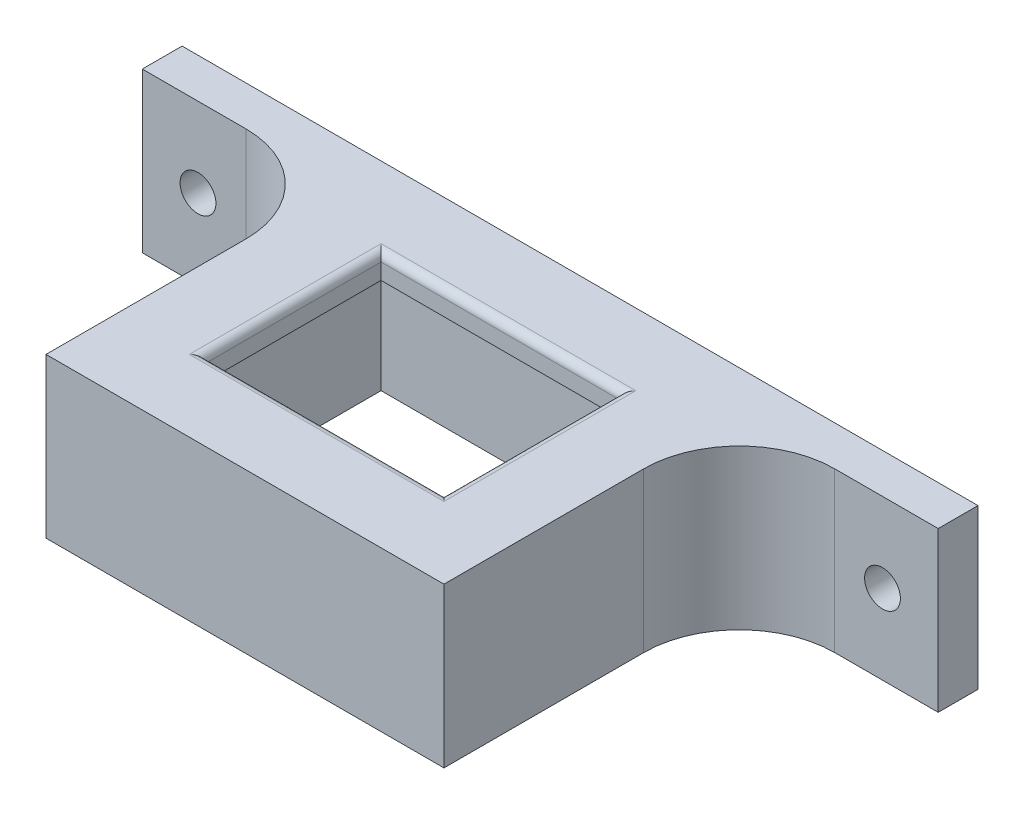
ISO-10303-21;
HEADER;
FILE_DESCRIPTION(('STEP AP214'),'2;1');
FILE_NAME('part.step','',(''),(''),'','','');
FILE_SCHEMA(('AUTOMOTIVE_DESIGN { 1 0 10303 214 1 1 1 1 }'));
ENDSEC;
DATA;
#1=APPLICATION_CONTEXT('core data for automotive mechanical design processes');
#2=APPLICATION_PROTOCOL_DEFINITION('international standard','automotive_design',2000,#1);
#3=PRODUCT_CONTEXT('',#1,'mechanical');
#4=PRODUCT('Part','Part','',(#3));
#5=PRODUCT_RELATED_PRODUCT_CATEGORY('part','',(#4));
#6=PRODUCT_DEFINITION_FORMATION('','',#4);
#7=PRODUCT_DEFINITION_CONTEXT('part definition',#1,'design');
#8=PRODUCT_DEFINITION('design','',#6,#7);
#9=PRODUCT_DEFINITION_SHAPE('','',#8);
#10=(LENGTH_UNIT() NAMED_UNIT(*) SI_UNIT(.MILLI.,.METRE.));
#11=(NAMED_UNIT(*) PLANE_ANGLE_UNIT() SI_UNIT($,.RADIAN.));
#12=(NAMED_UNIT(*) SI_UNIT($,.STERADIAN.) SOLID_ANGLE_UNIT());
#13=UNCERTAINTY_MEASURE_WITH_UNIT(LENGTH_MEASURE(1.E-05),#10,'distance_accuracy_value','');
#14=(GEOMETRIC_REPRESENTATION_CONTEXT(3) GLOBAL_UNCERTAINTY_ASSIGNED_CONTEXT((#13)) GLOBAL_UNIT_ASSIGNED_CONTEXT((#10,
#11,#12)) REPRESENTATION_CONTEXT('',''));
#15=CARTESIAN_POINT('',(0.,0.,0.));
#16=DIRECTION('',(0.,0.,1.));
#17=DIRECTION('',(1.,0.,0.));
#18=AXIS2_PLACEMENT_3D('',#15,#16,#17);
#19=CARTESIAN_POINT('',(25.,-3.,21.05));
#20=DIRECTION('',(1.,0.,0.));
#21=DIRECTION('',(0.,0.,-1.));
#22=AXIS2_PLACEMENT_3D('',#19,#20,#21);
#23=PLANE('',#22);
#24=DIRECTION('',(0.,0.,1.));
#25=VECTOR('',#24,1.);
#26=CARTESIAN_POINT('',(25.,-20.,-21.05));
#27=LINE('',#26,#25);
#28=CARTESIAN_POINT('',(25.,-20.,-4.05));
#29=VERTEX_POINT('',#28);
#30=CARTESIAN_POINT('',(25.,-20.,21.05));
#31=VERTEX_POINT('',#30);
#32=EDGE_CURVE('E293',#29,#31,#27,.T.);
#33=ORIENTED_EDGE('',*,*,#32,.F.);
#34=DIRECTION('',(0.,1.,0.));
#35=VECTOR('',#34,1.);
#36=CARTESIAN_POINT('',(25.,0.,-4.05));
#37=LINE('',#36,#35);
#38=CARTESIAN_POINT('',(25.,0.,-4.05));
#39=VERTEX_POINT('',#38);
#40=EDGE_CURVE('E405',#29,#39,#37,.T.);
#41=ORIENTED_EDGE('',*,*,#40,.T.);
#42=DIRECTION('',(0.,0.,-1.));
#43=VECTOR('',#42,1.);
#44=CARTESIAN_POINT('',(25.,0.,21.05));
#45=LINE('',#44,#43);
#46=CARTESIAN_POINT('',(25.,0.,21.05));
#47=VERTEX_POINT('',#46);
#48=EDGE_CURVE('E338',#47,#39,#45,.T.);
#49=ORIENTED_EDGE('',*,*,#48,.F.);
#50=DIRECTION('',(0.,1.,0.));
#51=VECTOR('',#50,1.);
#52=CARTESIAN_POINT('',(25.,-3.,21.05));
#53=LINE('',#52,#51);
#54=EDGE_CURVE('E347',#31,#47,#53,.T.);
#55=ORIENTED_EDGE('',*,*,#54,.F.);
#56=EDGE_LOOP('',(#33,#41,#49,#55));
#57=FACE_BOUND('',#56,.T.);
#58=ADVANCED_FACE('F39',(#57),#23,.T.);
#59=CARTESIAN_POINT('',(-25.,-3.,21.05));
#60=DIRECTION('',(0.,0.,1.));
#61=DIRECTION('',(1.,0.,0.));
#62=AXIS2_PLACEMENT_3D('',#59,#60,#61);
#63=PLANE('',#62);
#64=DIRECTION('',(1.,0.,0.));
#65=VECTOR('',#64,1.);
#66=CARTESIAN_POINT('',(-25.,0.,21.05));
#67=LINE('',#66,#65);
#68=CARTESIAN_POINT('',(-25.,0.,21.05));
#69=VERTEX_POINT('',#68);
#70=EDGE_CURVE('E323',#69,#47,#67,.T.);
#71=ORIENTED_EDGE('',*,*,#70,.F.);
#72=DIRECTION('',(0.,1.,0.));
#73=VECTOR('',#72,1.);
#74=CARTESIAN_POINT('',(-25.,-3.,21.05));
#75=LINE('',#74,#73);
#76=CARTESIAN_POINT('',(-25.,-20.,21.05));
#77=VERTEX_POINT('',#76);
#78=EDGE_CURVE('E348',#77,#69,#75,.T.);
#79=ORIENTED_EDGE('',*,*,#78,.F.);
#80=DIRECTION('',(-1.,0.,0.));
#81=VECTOR('',#80,1.);
#82=CARTESIAN_POINT('',(25.,-20.,21.05));
#83=LINE('',#82,#81);
#84=EDGE_CURVE('E296',#31,#77,#83,.T.);
#85=ORIENTED_EDGE('',*,*,#84,.F.);
#86=ORIENTED_EDGE('',*,*,#54,.T.);
#87=EDGE_LOOP('',(#71,#79,#85,#86));
#88=FACE_BOUND('',#87,.T.);
#89=ADVANCED_FACE('F437',(#88),#63,.T.);
#90=CARTESIAN_POINT('',(-25.,-3.,21.05));
#91=DIRECTION('',(-1.,0.,0.));
#92=DIRECTION('',(0.,0.,1.));
#93=AXIS2_PLACEMENT_3D('',#90,#91,#92);
#94=PLANE('',#93);
#95=DIRECTION('',(0.,0.,1.));
#96=VECTOR('',#95,1.);
#97=CARTESIAN_POINT('',(-25.,0.,21.05));
#98=LINE('',#97,#96);
#99=CARTESIAN_POINT('',(-25.,0.,-4.05));
#100=VERTEX_POINT('',#99);
#101=EDGE_CURVE('E344',#100,#69,#98,.T.);
#102=ORIENTED_EDGE('',*,*,#101,.F.);
#103=DIRECTION('',(0.,1.,0.));
#104=VECTOR('',#103,1.);
#105=CARTESIAN_POINT('',(-25.,-20.,-4.05));
#106=LINE('',#105,#104);
#107=CARTESIAN_POINT('',(-25.,-20.,-4.05));
#108=VERTEX_POINT('',#107);
#109=EDGE_CURVE('E402',#100,#108,#106,.F.);
#110=ORIENTED_EDGE('',*,*,#109,.T.);
#111=DIRECTION('',(0.,0.,-1.));
#112=VECTOR('',#111,1.);
#113=CARTESIAN_POINT('',(-25.,-20.,-21.05));
#114=LINE('',#113,#112);
#115=EDGE_CURVE('E287',#77,#108,#114,.T.);
#116=ORIENTED_EDGE('',*,*,#115,.F.);
#117=ORIENTED_EDGE('',*,*,#78,.T.);
#118=EDGE_LOOP('',(#102,#110,#116,#117));
#119=FACE_BOUND('',#118,.T.);
#120=ADVANCED_FACE('F421',(#119),#94,.T.);
#121=CARTESIAN_POINT('',(-25.,-3.,-21.05));
#122=DIRECTION('',(0.,0.,-1.));
#123=DIRECTION('',(-1.,0.,0.));
#124=AXIS2_PLACEMENT_3D('',#121,#122,#123);
#125=PLANE('',#124);
#126=CARTESIAN_POINT('',(-43.,-10.,-21.05));
#127=DIRECTION('',(0.,0.,-1.));
#128=DIRECTION('',(-1.,0.,0.));
#129=AXIS2_PLACEMENT_3D('',#126,#127,#128);
#130=CIRCLE('',#129,2.275);
#131=CARTESIAN_POINT('',(-45.275,-10.,-21.05));
#132=VERTEX_POINT('',#131);
#133=EDGE_CURVE('E517',#132,#132,#130,.T.);
#134=ORIENTED_EDGE('',*,*,#133,.F.);
#135=EDGE_LOOP('',(#134));
#136=FACE_BOUND('',#135,.T.);
#137=CARTESIAN_POINT('',(43.,-10.,-21.05));
#138=DIRECTION('',(0.,0.,-1.));
#139=DIRECTION('',(-1.,0.,0.));
#140=AXIS2_PLACEMENT_3D('',#137,#138,#139);
#141=CIRCLE('',#140,2.275);
#142=CARTESIAN_POINT('',(40.725,-10.,-21.05));
#143=VERTEX_POINT('',#142);
#144=EDGE_CURVE('E204',#143,#143,#141,.T.);
#145=ORIENTED_EDGE('',*,*,#144,.F.);
#146=EDGE_LOOP('',(#145));
#147=FACE_BOUND('',#146,.T.);
#148=DIRECTION('',(-1.,0.,0.));
#149=VECTOR('',#148,1.);
#150=CARTESIAN_POINT('',(-25.,0.,-21.05));
#151=LINE('',#150,#149);
#152=CARTESIAN_POINT('',(50.,0.,-21.05));
#153=VERTEX_POINT('',#152);
#154=CARTESIAN_POINT('',(-50.,0.,-21.05));
#155=VERTEX_POINT('',#154);
#156=EDGE_CURVE('E341',#153,#155,#151,.T.);
#157=ORIENTED_EDGE('',*,*,#156,.F.);
#158=DIRECTION('',(0.,-1.,0.));
#159=VECTOR('',#158,1.);
#160=CARTESIAN_POINT('',(50.,0.,-21.05));
#161=LINE('',#160,#159);
#162=CARTESIAN_POINT('',(50.,-20.,-21.05));
#163=VERTEX_POINT('',#162);
#164=EDGE_CURVE('E223',#153,#163,#161,.T.);
#165=ORIENTED_EDGE('',*,*,#164,.T.);
#166=DIRECTION('',(1.,0.,0.));
#167=VECTOR('',#166,1.);
#168=CARTESIAN_POINT('',(25.,-20.,-21.05));
#169=LINE('',#168,#167);
#170=CARTESIAN_POINT('',(-50.,-20.,-21.05));
#171=VERTEX_POINT('',#170);
#172=EDGE_CURVE('E290',#171,#163,#169,.T.);
#173=ORIENTED_EDGE('',*,*,#172,.F.);
#174=DIRECTION('',(0.,-1.,0.));
#175=VECTOR('',#174,1.);
#176=CARTESIAN_POINT('',(-50.,0.,-21.05));
#177=LINE('',#176,#175);
#178=EDGE_CURVE('E184',#155,#171,#177,.T.);
#179=ORIENTED_EDGE('',*,*,#178,.F.);
#180=EDGE_LOOP('',(#157,#165,#173,#179));
#181=FACE_BOUND('',#180,.T.);
#182=ADVANCED_FACE('F447',(#136,#147,#181),#125,.T.);
#183=CARTESIAN_POINT('',(0.,-3.,0.));
#184=DIRECTION('',(0.,1.,0.));
#185=DIRECTION('',(0.,0.,1.));
#186=AXIS2_PLACEMENT_3D('',#183,#184,#185);
#187=PLANE('',#186);
#188=DIRECTION('',(0.,0.,-1.));
#189=VECTOR('',#188,1.);
#190=CARTESIAN_POINT('',(-20.,-3.,-16.05));
#191=LINE('',#190,#189);
#192=CARTESIAN_POINT('',(-20.,-3.,16.05));
#193=VERTEX_POINT('',#192);
#194=CARTESIAN_POINT('',(-20.,-3.,-16.05));
#195=VERTEX_POINT('',#194);
#196=EDGE_CURVE('E250',#193,#195,#191,.T.);
#197=ORIENTED_EDGE('',*,*,#196,.T.);
#198=DIRECTION('',(1.,0.,0.));
#199=VECTOR('',#198,1.);
#200=CARTESIAN_POINT('',(20.,-3.,-16.05));
#201=LINE('',#200,#199);
#202=CARTESIAN_POINT('',(20.,-3.,-16.05));
#203=VERTEX_POINT('',#202);
#204=EDGE_CURVE('E234',#195,#203,#201,.T.);
#205=ORIENTED_EDGE('',*,*,#204,.T.);
#206=DIRECTION('',(0.,0.,1.));
#207=VECTOR('',#206,1.);
#208=CARTESIAN_POINT('',(20.,-3.,-16.05));
#209=LINE('',#208,#207);
#210=CARTESIAN_POINT('',(20.,-3.,16.05));
#211=VERTEX_POINT('',#210);
#212=EDGE_CURVE('E264',#203,#211,#209,.T.);
#213=ORIENTED_EDGE('',*,*,#212,.T.);
#214=DIRECTION('',(-1.,0.,0.));
#215=VECTOR('',#214,1.);
#216=CARTESIAN_POINT('',(20.,-3.,16.05));
#217=LINE('',#216,#215);
#218=EDGE_CURVE('E268',#211,#193,#217,.T.);
#219=ORIENTED_EDGE('',*,*,#218,.T.);
#220=EDGE_LOOP('',(#197,#205,#213,#219));
#221=FACE_BOUND('',#220,.T.);
#222=DIRECTION('',(1.,0.,0.));
#223=VECTOR('',#222,1.);
#224=CARTESIAN_POINT('',(-15.,-3.,11.05));
#225=LINE('',#224,#223);
#226=CARTESIAN_POINT('',(-15.,-3.,11.05));
#227=VERTEX_POINT('',#226);
#228=CARTESIAN_POINT('',(15.,-3.,11.05));
#229=VERTEX_POINT('',#228);
#230=EDGE_CURVE('E314',#227,#229,#225,.T.);
#231=ORIENTED_EDGE('',*,*,#230,.T.);
#232=DIRECTION('',(0.,0.,-1.));
#233=VECTOR('',#232,1.);
#234=CARTESIAN_POINT('',(15.,-3.,11.05));
#235=LINE('',#234,#233);
#236=CARTESIAN_POINT('',(15.,-3.,-11.05));
#237=VERTEX_POINT('',#236);
#238=EDGE_CURVE('E301',#229,#237,#235,.T.);
#239=ORIENTED_EDGE('',*,*,#238,.T.);
#240=DIRECTION('',(-1.,0.,0.));
#241=VECTOR('',#240,1.);
#242=CARTESIAN_POINT('',(-15.,-3.,-11.05));
#243=LINE('',#242,#241);
#244=CARTESIAN_POINT('',(-15.,-3.,-11.05));
#245=VERTEX_POINT('',#244);
#246=EDGE_CURVE('E305',#237,#245,#243,.T.);
#247=ORIENTED_EDGE('',*,*,#246,.T.);
#248=DIRECTION('',(0.,0.,1.));
#249=VECTOR('',#248,1.);
#250=CARTESIAN_POINT('',(-15.,-3.,11.05));
#251=LINE('',#250,#249);
#252=EDGE_CURVE('E310',#245,#227,#251,.T.);
#253=ORIENTED_EDGE('',*,*,#252,.T.);
#254=EDGE_LOOP('',(#231,#239,#247,#253));
#255=FACE_BOUND('',#254,.T.);
#256=ADVANCED_FACE('F491',(#221,#255),#187,.F.);
#257=CARTESIAN_POINT('',(0.,0.,0.));
#258=DIRECTION('',(0.,1.,0.));
#259=DIRECTION('',(0.,0.,1.));
#260=AXIS2_PLACEMENT_3D('',#257,#258,#259);
#261=PLANE('',#260);
#262=DIRECTION('',(0.,0.,-1.));
#263=VECTOR('',#262,1.);
#264=CARTESIAN_POINT('',(16.,0.,11.05));
#265=LINE('',#264,#263);
#266=CARTESIAN_POINT('',(16.,0.,-12.05));
#267=VERTEX_POINT('',#266);
#268=CARTESIAN_POINT('',(16.,0.,12.05));
#269=VERTEX_POINT('',#268);
#270=EDGE_CURVE('E364',#267,#269,#265,.F.);
#271=ORIENTED_EDGE('',*,*,#270,.T.);
#272=DIRECTION('',(1.,0.,0.));
#273=VECTOR('',#272,1.);
#274=CARTESIAN_POINT('',(-15.,0.,12.05));
#275=LINE('',#274,#273);
#276=CARTESIAN_POINT('',(-16.,0.,12.05));
#277=VERTEX_POINT('',#276);
#278=EDGE_CURVE('E367',#269,#277,#275,.F.);
#279=ORIENTED_EDGE('',*,*,#278,.T.);
#280=DIRECTION('',(0.,0.,1.));
#281=VECTOR('',#280,1.);
#282=CARTESIAN_POINT('',(-16.,0.,-11.05));
#283=LINE('',#282,#281);
#284=CARTESIAN_POINT('',(-16.,0.,-12.05));
#285=VERTEX_POINT('',#284);
#286=EDGE_CURVE('E358',#277,#285,#283,.F.);
#287=ORIENTED_EDGE('',*,*,#286,.T.);
#288=DIRECTION('',(-1.,0.,0.));
#289=VECTOR('',#288,1.);
#290=CARTESIAN_POINT('',(15.,0.,-12.05));
#291=LINE('',#290,#289);
#292=EDGE_CURVE('E361',#285,#267,#291,.F.);
#293=ORIENTED_EDGE('',*,*,#292,.T.);
#294=EDGE_LOOP('',(#271,#279,#287,#293));
#295=FACE_BOUND('',#294,.T.);
#296=ORIENTED_EDGE('',*,*,#70,.T.);
#297=ORIENTED_EDGE('',*,*,#48,.T.);
#298=CARTESIAN_POINT('',(37.,0.,-4.05));
#299=DIRECTION('',(0.,1.,0.));
#300=DIRECTION('',(0.,0.,1.));
#301=AXIS2_PLACEMENT_3D('',#298,#299,#300);
#302=CIRCLE('',#301,12.);
#303=CARTESIAN_POINT('',(37.,0.,-16.05));
#304=VERTEX_POINT('',#303);
#305=EDGE_CURVE('E48',#39,#304,#302,.F.);
#306=ORIENTED_EDGE('',*,*,#305,.T.);
#307=DIRECTION('',(1.,0.,0.));
#308=VECTOR('',#307,1.);
#309=CARTESIAN_POINT('',(25.,0.,-16.05));
#310=LINE('',#309,#308);
#311=CARTESIAN_POINT('',(50.,0.,-16.05));
#312=VERTEX_POINT('',#311);
#313=EDGE_CURVE('E227',#304,#312,#310,.T.);
#314=ORIENTED_EDGE('',*,*,#313,.T.);
#315=DIRECTION('',(0.,0.,-1.));
#316=VECTOR('',#315,1.);
#317=CARTESIAN_POINT('',(50.,0.,15.9656211871643));
#318=LINE('',#317,#316);
#319=EDGE_CURVE('E230',#312,#153,#318,.T.);
#320=ORIENTED_EDGE('',*,*,#319,.T.);
#321=ORIENTED_EDGE('',*,*,#156,.T.);
#322=DIRECTION('',(0.,0.,-1.));
#323=VECTOR('',#322,1.);
#324=CARTESIAN_POINT('',(-50.,0.,15.9656211871643));
#325=LINE('',#324,#323);
#326=CARTESIAN_POINT('',(-50.,0.,-16.05));
#327=VERTEX_POINT('',#326);
#328=EDGE_CURVE('E215',#327,#155,#325,.T.);
#329=ORIENTED_EDGE('',*,*,#328,.F.);
#330=DIRECTION('',(-1.,0.,0.));
#331=VECTOR('',#330,1.);
#332=CARTESIAN_POINT('',(-25.,0.,-16.05));
#333=LINE('',#332,#331);
#334=CARTESIAN_POINT('',(-37.,0.,-16.05));
#335=VERTEX_POINT('',#334);
#336=EDGE_CURVE('E199',#335,#327,#333,.T.);
#337=ORIENTED_EDGE('',*,*,#336,.F.);
#338=CARTESIAN_POINT('',(-37.,0.,-4.05));
#339=DIRECTION('',(0.,1.,0.));
#340=DIRECTION('',(0.,0.,1.));
#341=AXIS2_PLACEMENT_3D('',#338,#339,#340);
#342=CIRCLE('',#341,12.);
#343=EDGE_CURVE('E411',#335,#100,#342,.F.);
#344=ORIENTED_EDGE('',*,*,#343,.T.);
#345=ORIENTED_EDGE('',*,*,#101,.T.);
#346=EDGE_LOOP('',(#296,#297,#306,#314,#320,#321,#329,#337,#344,#345));
#347=FACE_BOUND('',#346,.T.);
#348=ADVANCED_FACE('F417',(#295,#347),#261,.T.);
#349=CARTESIAN_POINT('',(15.,-3.,11.05));
#350=DIRECTION('',(1.,0.,0.));
#351=DIRECTION('',(0.,0.,-1.));
#352=AXIS2_PLACEMENT_3D('',#349,#350,#351);
#353=PLANE('',#352);
#354=DIRECTION('',(0.,1.,0.));
#355=VECTOR('',#354,1.);
#356=CARTESIAN_POINT('',(15.,-3.,11.05));
#357=LINE('',#356,#355);
#358=CARTESIAN_POINT('',(15.,-1.,11.05));
#359=VERTEX_POINT('',#358);
#360=EDGE_CURVE('E319',#229,#359,#357,.T.);
#361=ORIENTED_EDGE('',*,*,#360,.T.);
#362=DIRECTION('',(0.,0.,-1.));
#363=VECTOR('',#362,1.);
#364=CARTESIAN_POINT('',(15.,-1.,-11.05));
#365=LINE('',#364,#363);
#366=CARTESIAN_POINT('',(15.,-1.,-11.05));
#367=VERTEX_POINT('',#366);
#368=EDGE_CURVE('E371',#359,#367,#365,.T.);
#369=ORIENTED_EDGE('',*,*,#368,.T.);
#370=DIRECTION('',(0.,1.,0.));
#371=VECTOR('',#370,1.);
#372=CARTESIAN_POINT('',(15.,-3.,-11.05));
#373=LINE('',#372,#371);
#374=EDGE_CURVE('E318',#237,#367,#373,.T.);
#375=ORIENTED_EDGE('',*,*,#374,.F.);
#376=ORIENTED_EDGE('',*,*,#238,.F.);
#377=EDGE_LOOP('',(#361,#369,#375,#376));
#378=FACE_BOUND('',#377,.T.);
#379=ADVANCED_FACE('F494',(#378),#353,.F.);
#380=CARTESIAN_POINT('',(-15.,-3.,11.05));
#381=DIRECTION('',(0.,0.,1.));
#382=DIRECTION('',(1.,0.,0.));
#383=AXIS2_PLACEMENT_3D('',#380,#381,#382);
#384=PLANE('',#383);
#385=DIRECTION('',(0.,1.,0.));
#386=VECTOR('',#385,1.);
#387=CARTESIAN_POINT('',(-15.,-3.,11.05));
#388=LINE('',#387,#386);
#389=CARTESIAN_POINT('',(-15.,-1.,11.05));
#390=VERTEX_POINT('',#389);
#391=EDGE_CURVE('E324',#227,#390,#388,.T.);
#392=ORIENTED_EDGE('',*,*,#391,.T.);
#393=DIRECTION('',(1.,0.,0.));
#394=VECTOR('',#393,1.);
#395=CARTESIAN_POINT('',(15.,-1.,11.05));
#396=LINE('',#395,#394);
#397=EDGE_CURVE('E352',#390,#359,#396,.T.);
#398=ORIENTED_EDGE('',*,*,#397,.T.);
#399=ORIENTED_EDGE('',*,*,#360,.F.);
#400=ORIENTED_EDGE('',*,*,#230,.F.);
#401=EDGE_LOOP('',(#392,#398,#399,#400));
#402=FACE_BOUND('',#401,.T.);
#403=ADVANCED_FACE('F488',(#402),#384,.F.);
#404=CARTESIAN_POINT('',(-15.,-3.,11.05));
#405=DIRECTION('',(-1.,0.,0.));
#406=DIRECTION('',(0.,0.,1.));
#407=AXIS2_PLACEMENT_3D('',#404,#405,#406);
#408=PLANE('',#407);
#409=DIRECTION('',(0.,1.,0.));
#410=VECTOR('',#409,1.);
#411=CARTESIAN_POINT('',(-15.,-3.,-11.05));
#412=LINE('',#411,#410);
#413=CARTESIAN_POINT('',(-15.,-1.,-11.05));
#414=VERTEX_POINT('',#413);
#415=EDGE_CURVE('E328',#245,#414,#412,.T.);
#416=ORIENTED_EDGE('',*,*,#415,.T.);
#417=DIRECTION('',(0.,0.,1.));
#418=VECTOR('',#417,1.);
#419=CARTESIAN_POINT('',(-15.,-1.,11.05));
#420=LINE('',#419,#418);
#421=EDGE_CURVE('E377',#414,#390,#420,.T.);
#422=ORIENTED_EDGE('',*,*,#421,.T.);
#423=ORIENTED_EDGE('',*,*,#391,.F.);
#424=ORIENTED_EDGE('',*,*,#252,.F.);
#425=EDGE_LOOP('',(#416,#422,#423,#424));
#426=FACE_BOUND('',#425,.T.);
#427=ADVANCED_FACE('F468',(#426),#408,.F.);
#428=CARTESIAN_POINT('',(-15.,-3.,-11.05));
#429=DIRECTION('',(0.,0.,-1.));
#430=DIRECTION('',(-1.,0.,0.));
#431=AXIS2_PLACEMENT_3D('',#428,#429,#430);
#432=PLANE('',#431);
#433=ORIENTED_EDGE('',*,*,#374,.T.);
#434=DIRECTION('',(-1.,0.,0.));
#435=VECTOR('',#434,1.);
#436=CARTESIAN_POINT('',(-15.,-1.,-11.05));
#437=LINE('',#436,#435);
#438=EDGE_CURVE('E374',#367,#414,#437,.T.);
#439=ORIENTED_EDGE('',*,*,#438,.T.);
#440=ORIENTED_EDGE('',*,*,#415,.F.);
#441=ORIENTED_EDGE('',*,*,#246,.F.);
#442=EDGE_LOOP('',(#433,#439,#440,#441));
#443=FACE_BOUND('',#442,.T.);
#444=ADVANCED_FACE('F463',(#443),#432,.F.);
#445=CARTESIAN_POINT('',(-15.,-1.,-12.05));
#446=DIRECTION('',(1.,0.,0.));
#447=DIRECTION('',(0.,0.,-1.));
#448=AXIS2_PLACEMENT_3D('',#445,#446,#447);
#449=CYLINDRICAL_SURFACE('',#448,1.);
#450=CARTESIAN_POINT('',(16.,-1.,-12.05));
#451=DIRECTION('',(0.707106781186547,0.,0.707106781186547));
#452=DIRECTION('',(-0.707106781186547,0.,0.707106781186547));
#453=AXIS2_PLACEMENT_3D('',#450,#451,#452);
#454=ELLIPSE('',#453,1.41421356237309,1.);
#455=EDGE_CURVE('E386',#267,#367,#454,.T.);
#456=ORIENTED_EDGE('',*,*,#455,.F.);
#457=ORIENTED_EDGE('',*,*,#292,.F.);
#458=CARTESIAN_POINT('',(-16.,-1.,-12.05));
#459=DIRECTION('',(0.707106781186547,0.,-0.707106781186547));
#460=DIRECTION('',(0.707106781186547,0.,0.707106781186547));
#461=AXIS2_PLACEMENT_3D('',#458,#459,#460);
#462=ELLIPSE('',#461,1.41421356237309,1.);
#463=EDGE_CURVE('E306',#414,#285,#462,.F.);
#464=ORIENTED_EDGE('',*,*,#463,.F.);
#465=ORIENTED_EDGE('',*,*,#438,.F.);
#466=EDGE_LOOP('',(#456,#457,#464,#465));
#467=FACE_BOUND('',#466,.T.);
#468=ADVANCED_FACE('F460',(#467),#449,.T.);
#469=CARTESIAN_POINT('',(-16.,-1.,11.05));
#470=DIRECTION('',(0.,0.,-1.));
#471=DIRECTION('',(-1.,0.,0.));
#472=AXIS2_PLACEMENT_3D('',#469,#470,#471);
#473=CYLINDRICAL_SURFACE('',#472,1.);
#474=ORIENTED_EDGE('',*,*,#463,.T.);
#475=ORIENTED_EDGE('',*,*,#286,.F.);
#476=CARTESIAN_POINT('',(-16.,-1.,12.05));
#477=DIRECTION('',(-0.707106781186547,0.,-0.707106781186547));
#478=DIRECTION('',(-0.707106781186547,0.,0.707106781186547));
#479=AXIS2_PLACEMENT_3D('',#476,#477,#478);
#480=ELLIPSE('',#479,1.41421356237309,1.);
#481=EDGE_CURVE('E383',#390,#277,#480,.F.);
#482=ORIENTED_EDGE('',*,*,#481,.F.);
#483=ORIENTED_EDGE('',*,*,#421,.F.);
#484=EDGE_LOOP('',(#474,#475,#482,#483));
#485=FACE_BOUND('',#484,.T.);
#486=ADVANCED_FACE('F457',(#485),#473,.T.);
#487=CARTESIAN_POINT('',(16.,-1.,11.05));
#488=DIRECTION('',(0.,0.,1.));
#489=DIRECTION('',(1.,0.,0.));
#490=AXIS2_PLACEMENT_3D('',#487,#488,#489);
#491=CYLINDRICAL_SURFACE('',#490,1.);
#492=ORIENTED_EDGE('',*,*,#455,.T.);
#493=ORIENTED_EDGE('',*,*,#368,.F.);
#494=CARTESIAN_POINT('',(16.,-1.,12.05));
#495=DIRECTION('',(-0.707106781186547,0.,0.707106781186547));
#496=DIRECTION('',(-0.707106781186547,0.,-0.707106781186547));
#497=AXIS2_PLACEMENT_3D('',#494,#495,#496);
#498=ELLIPSE('',#497,1.41421356237309,1.);
#499=EDGE_CURVE('E300',#269,#359,#498,.T.);
#500=ORIENTED_EDGE('',*,*,#499,.F.);
#501=ORIENTED_EDGE('',*,*,#270,.F.);
#502=EDGE_LOOP('',(#492,#493,#500,#501));
#503=FACE_BOUND('',#502,.T.);
#504=ADVANCED_FACE('F453',(#503),#491,.T.);
#505=CARTESIAN_POINT('',(-15.,-1.,12.05));
#506=DIRECTION('',(-1.,0.,0.));
#507=DIRECTION('',(0.,0.,1.));
#508=AXIS2_PLACEMENT_3D('',#505,#506,#507);
#509=CYLINDRICAL_SURFACE('',#508,1.);
#510=ORIENTED_EDGE('',*,*,#481,.T.);
#511=ORIENTED_EDGE('',*,*,#278,.F.);
#512=ORIENTED_EDGE('',*,*,#499,.T.);
#513=ORIENTED_EDGE('',*,*,#397,.F.);
#514=EDGE_LOOP('',(#510,#511,#512,#513));
#515=FACE_BOUND('',#514,.T.);
#516=ADVANCED_FACE('F450',(#515),#509,.T.);
#517=CARTESIAN_POINT('',(0.,-20.,0.));
#518=DIRECTION('',(0.,-1.,0.));
#519=DIRECTION('',(0.,0.,-1.));
#520=AXIS2_PLACEMENT_3D('',#517,#518,#519);
#521=PLANE('',#520);
#522=ORIENTED_EDGE('',*,*,#115,.T.);
#523=CARTESIAN_POINT('',(-37.,-20.,-4.05));
#524=DIRECTION('',(0.,-1.,0.));
#525=DIRECTION('',(0.,0.,-1.));
#526=AXIS2_PLACEMENT_3D('',#523,#524,#525);
#527=CIRCLE('',#526,12.);
#528=CARTESIAN_POINT('',(-37.,-20.,-16.05));
#529=VERTEX_POINT('',#528);
#530=EDGE_CURVE('E194',#108,#529,#527,.F.);
#531=ORIENTED_EDGE('',*,*,#530,.T.);
#532=DIRECTION('',(1.,0.,0.));
#533=VECTOR('',#532,1.);
#534=CARTESIAN_POINT('',(-25.,-20.,-16.05));
#535=LINE('',#534,#533);
#536=CARTESIAN_POINT('',(-50.,-20.,-16.05));
#537=VERTEX_POINT('',#536);
#538=EDGE_CURVE('E187',#537,#529,#535,.T.);
#539=ORIENTED_EDGE('',*,*,#538,.F.);
#540=DIRECTION('',(0.,0.,-1.));
#541=VECTOR('',#540,1.);
#542=CARTESIAN_POINT('',(-50.,-20.,15.9656211871643));
#543=LINE('',#542,#541);
#544=EDGE_CURVE('E176',#537,#171,#543,.T.);
#545=ORIENTED_EDGE('',*,*,#544,.T.);
#546=ORIENTED_EDGE('',*,*,#172,.T.);
#547=DIRECTION('',(0.,0.,-1.));
#548=VECTOR('',#547,1.);
#549=CARTESIAN_POINT('',(50.,-20.,15.9656211871643));
#550=LINE('',#549,#548);
#551=CARTESIAN_POINT('',(50.,-20.,-16.05));
#552=VERTEX_POINT('',#551);
#553=EDGE_CURVE('E235',#552,#163,#550,.T.);
#554=ORIENTED_EDGE('',*,*,#553,.F.);
#555=DIRECTION('',(-1.,0.,0.));
#556=VECTOR('',#555,1.);
#557=CARTESIAN_POINT('',(25.,-20.,-16.05));
#558=LINE('',#557,#556);
#559=CARTESIAN_POINT('',(37.,-20.,-16.05));
#560=VERTEX_POINT('',#559);
#561=EDGE_CURVE('E231',#552,#560,#558,.T.);
#562=ORIENTED_EDGE('',*,*,#561,.T.);
#563=CARTESIAN_POINT('',(37.,-20.,-4.05));
#564=DIRECTION('',(0.,-1.,0.));
#565=DIRECTION('',(0.,0.,-1.));
#566=AXIS2_PLACEMENT_3D('',#563,#564,#565);
#567=CIRCLE('',#566,12.);
#568=EDGE_CURVE('E11',#560,#29,#567,.F.);
#569=ORIENTED_EDGE('',*,*,#568,.T.);
#570=ORIENTED_EDGE('',*,*,#32,.T.);
#571=ORIENTED_EDGE('',*,*,#84,.T.);
#572=EDGE_LOOP('',(#522,#531,#539,#545,#546,#554,#562,#569,#570,#571));
#573=FACE_BOUND('',#572,.T.);
#574=DIRECTION('',(0.,0.,1.));
#575=VECTOR('',#574,1.);
#576=CARTESIAN_POINT('',(20.,-20.,-16.05));
#577=LINE('',#576,#575);
#578=CARTESIAN_POINT('',(20.,-20.,-16.05));
#579=VERTEX_POINT('',#578);
#580=CARTESIAN_POINT('',(20.,-20.,16.05));
#581=VERTEX_POINT('',#580);
#582=EDGE_CURVE('E249',#579,#581,#577,.T.);
#583=ORIENTED_EDGE('',*,*,#582,.F.);
#584=DIRECTION('',(1.,0.,0.));
#585=VECTOR('',#584,1.);
#586=CARTESIAN_POINT('',(20.,-20.,-16.05));
#587=LINE('',#586,#585);
#588=CARTESIAN_POINT('',(-20.,-20.,-16.05));
#589=VERTEX_POINT('',#588);
#590=EDGE_CURVE('E246',#589,#579,#587,.T.);
#591=ORIENTED_EDGE('',*,*,#590,.F.);
#592=DIRECTION('',(0.,0.,-1.));
#593=VECTOR('',#592,1.);
#594=CARTESIAN_POINT('',(-20.,-20.,-16.05));
#595=LINE('',#594,#593);
#596=CARTESIAN_POINT('',(-20.,-20.,16.05));
#597=VERTEX_POINT('',#596);
#598=EDGE_CURVE('E257',#597,#589,#595,.T.);
#599=ORIENTED_EDGE('',*,*,#598,.F.);
#600=DIRECTION('',(-1.,0.,0.));
#601=VECTOR('',#600,1.);
#602=CARTESIAN_POINT('',(20.,-20.,16.05));
#603=LINE('',#602,#601);
#604=EDGE_CURVE('E253',#581,#597,#603,.T.);
#605=ORIENTED_EDGE('',*,*,#604,.F.);
#606=EDGE_LOOP('',(#583,#591,#599,#605));
#607=FACE_BOUND('',#606,.T.);
#608=ADVANCED_FACE('F191',(#573,#607),#521,.T.);
#609=CARTESIAN_POINT('',(20.,-20.,-16.05));
#610=DIRECTION('',(0.,0.,1.));
#611=DIRECTION('',(1.,0.,0.));
#612=AXIS2_PLACEMENT_3D('',#609,#610,#611);
#613=PLANE('',#612);
#614=ORIENTED_EDGE('',*,*,#204,.F.);
#615=DIRECTION('',(0.,1.,0.));
#616=VECTOR('',#615,1.);
#617=CARTESIAN_POINT('',(-20.,-20.,-16.05));
#618=LINE('',#617,#616);
#619=EDGE_CURVE('E260',#589,#195,#618,.T.);
#620=ORIENTED_EDGE('',*,*,#619,.F.);
#621=ORIENTED_EDGE('',*,*,#590,.T.);
#622=DIRECTION('',(0.,1.,0.));
#623=VECTOR('',#622,1.);
#624=CARTESIAN_POINT('',(20.,-20.,-16.05));
#625=LINE('',#624,#623);
#626=EDGE_CURVE('E283',#579,#203,#625,.T.);
#627=ORIENTED_EDGE('',*,*,#626,.T.);
#628=EDGE_LOOP('',(#614,#620,#621,#627));
#629=FACE_BOUND('',#628,.T.);
#630=ADVANCED_FACE('F554',(#629),#613,.T.);
#631=CARTESIAN_POINT('',(20.,-20.,-16.05));
#632=DIRECTION('',(-1.,0.,0.));
#633=DIRECTION('',(0.,0.,1.));
#634=AXIS2_PLACEMENT_3D('',#631,#632,#633);
#635=PLANE('',#634);
#636=ORIENTED_EDGE('',*,*,#212,.F.);
#637=ORIENTED_EDGE('',*,*,#626,.F.);
#638=ORIENTED_EDGE('',*,*,#582,.T.);
#639=DIRECTION('',(0.,1.,0.));
#640=VECTOR('',#639,1.);
#641=CARTESIAN_POINT('',(20.,-20.,16.05));
#642=LINE('',#641,#640);
#643=EDGE_CURVE('E280',#581,#211,#642,.T.);
#644=ORIENTED_EDGE('',*,*,#643,.T.);
#645=EDGE_LOOP('',(#636,#637,#638,#644));
#646=FACE_BOUND('',#645,.T.);
#647=ADVANCED_FACE('F550',(#646),#635,.T.);
#648=CARTESIAN_POINT('',(20.,-20.,16.05));
#649=DIRECTION('',(0.,0.,-1.));
#650=DIRECTION('',(-1.,0.,0.));
#651=AXIS2_PLACEMENT_3D('',#648,#649,#650);
#652=PLANE('',#651);
#653=ORIENTED_EDGE('',*,*,#218,.F.);
#654=ORIENTED_EDGE('',*,*,#643,.F.);
#655=ORIENTED_EDGE('',*,*,#604,.T.);
#656=DIRECTION('',(0.,1.,0.));
#657=VECTOR('',#656,1.);
#658=CARTESIAN_POINT('',(-20.,-20.,16.05));
#659=LINE('',#658,#657);
#660=EDGE_CURVE('E277',#597,#193,#659,.T.);
#661=ORIENTED_EDGE('',*,*,#660,.T.);
#662=EDGE_LOOP('',(#653,#654,#655,#661));
#663=FACE_BOUND('',#662,.T.);
#664=ADVANCED_FACE('F542',(#663),#652,.T.);
#665=CARTESIAN_POINT('',(-20.,-20.,-16.05));
#666=DIRECTION('',(1.,0.,0.));
#667=DIRECTION('',(0.,0.,-1.));
#668=AXIS2_PLACEMENT_3D('',#665,#666,#667);
#669=PLANE('',#668);
#670=ORIENTED_EDGE('',*,*,#196,.F.);
#671=ORIENTED_EDGE('',*,*,#660,.F.);
#672=ORIENTED_EDGE('',*,*,#598,.T.);
#673=ORIENTED_EDGE('',*,*,#619,.T.);
#674=EDGE_LOOP('',(#670,#671,#672,#673));
#675=FACE_BOUND('',#674,.T.);
#676=ADVANCED_FACE('F533',(#675),#669,.T.);
#677=CARTESIAN_POINT('',(20.,-20.,-16.05));
#678=DIRECTION('',(0.,0.,1.));
#679=DIRECTION('',(1.,0.,0.));
#680=AXIS2_PLACEMENT_3D('',#677,#678,#679);
#681=PLANE('',#680);
#682=CARTESIAN_POINT('',(43.,-10.,-16.05));
#683=DIRECTION('',(0.,0.,1.));
#684=DIRECTION('',(1.,0.,0.));
#685=AXIS2_PLACEMENT_3D('',#682,#683,#684);
#686=CIRCLE('',#685,2.25);
#687=CARTESIAN_POINT('',(45.25,-10.,-16.05));
#688=VERTEX_POINT('',#687);
#689=EDGE_CURVE('E222',#688,#688,#686,.T.);
#690=ORIENTED_EDGE('',*,*,#689,.F.);
#691=EDGE_LOOP('',(#690));
#692=FACE_BOUND('',#691,.T.);
#693=ORIENTED_EDGE('',*,*,#313,.F.);
#694=DIRECTION('',(0.,1.,0.));
#695=VECTOR('',#694,1.);
#696=CARTESIAN_POINT('',(37.,-20.,-16.05));
#697=LINE('',#696,#695);
#698=EDGE_CURVE('E61',#304,#560,#697,.F.);
#699=ORIENTED_EDGE('',*,*,#698,.T.);
#700=ORIENTED_EDGE('',*,*,#561,.F.);
#701=DIRECTION('',(0.,-1.,0.));
#702=VECTOR('',#701,1.);
#703=CARTESIAN_POINT('',(50.,0.,-16.05));
#704=LINE('',#703,#702);
#705=EDGE_CURVE('E236',#312,#552,#704,.T.);
#706=ORIENTED_EDGE('',*,*,#705,.F.);
#707=EDGE_LOOP('',(#693,#699,#700,#706));
#708=FACE_BOUND('',#707,.T.);
#709=ADVANCED_FACE('F531',(#692,#708),#681,.T.);
#710=CARTESIAN_POINT('',(50.,0.,15.9656211871643));
#711=DIRECTION('',(1.,0.,0.));
#712=DIRECTION('',(0.,0.,-1.));
#713=AXIS2_PLACEMENT_3D('',#710,#711,#712);
#714=PLANE('',#713);
#715=ORIENTED_EDGE('',*,*,#319,.F.);
#716=ORIENTED_EDGE('',*,*,#705,.T.);
#717=ORIENTED_EDGE('',*,*,#553,.T.);
#718=ORIENTED_EDGE('',*,*,#164,.F.);
#719=EDGE_LOOP('',(#715,#716,#717,#718));
#720=FACE_BOUND('',#719,.T.);
#721=ADVANCED_FACE('F524',(#720),#714,.T.);
#722=CARTESIAN_POINT('',(43.,-10.,-21.05));
#723=DIRECTION('',(0.,0.,-1.));
#724=DIRECTION('',(-1.,0.,0.));
#725=AXIS2_PLACEMENT_3D('',#722,#723,#724);
#726=CYLINDRICAL_SURFACE('',#725,2.25);
#727=ORIENTED_EDGE('',*,*,#689,.T.);
#728=EDGE_LOOP('',(#727));
#729=FACE_BOUND('',#728,.T.);
#730=CARTESIAN_POINT('',(43.,-10.,-21.025));
#731=DIRECTION('',(0.,0.,-1.));
#732=DIRECTION('',(-1.,0.,0.));
#733=AXIS2_PLACEMENT_3D('',#730,#731,#732);
#734=CIRCLE('',#733,2.25);
#735=CARTESIAN_POINT('',(40.75,-10.,-21.025));
#736=VERTEX_POINT('',#735);
#737=EDGE_CURVE('E209',#736,#736,#734,.T.);
#738=ORIENTED_EDGE('',*,*,#737,.T.);
#739=EDGE_LOOP('',(#738));
#740=FACE_BOUND('',#739,.T.);
#741=ADVANCED_FACE('F540',(#729,#740),#726,.F.);
#742=CARTESIAN_POINT('',(43.,-10.,-21.05));
#743=DIRECTION('',(0.,0.,-1.));
#744=DIRECTION('',(-1.,0.,0.));
#745=AXIS2_PLACEMENT_3D('',#742,#743,#744);
#746=CONICAL_SURFACE('',#745,2.275,0.78539816339731);
#747=ORIENTED_EDGE('',*,*,#737,.F.);
#748=EDGE_LOOP('',(#747));
#749=FACE_BOUND('',#748,.T.);
#750=ORIENTED_EDGE('',*,*,#144,.T.);
#751=EDGE_LOOP('',(#750));
#752=FACE_BOUND('',#751,.T.);
#753=ADVANCED_FACE('F649',(#749,#752),#746,.F.);
#754=CARTESIAN_POINT('',(-50.,0.,15.9656211871643));
#755=DIRECTION('',(1.,0.,0.));
#756=DIRECTION('',(0.,0.,-1.));
#757=AXIS2_PLACEMENT_3D('',#754,#755,#756);
#758=PLANE('',#757);
#759=DIRECTION('',(0.,-1.,0.));
#760=VECTOR('',#759,1.);
#761=CARTESIAN_POINT('',(-50.,0.,-16.05));
#762=LINE('',#761,#760);
#763=EDGE_CURVE('E181',#327,#537,#762,.T.);
#764=ORIENTED_EDGE('',*,*,#763,.F.);
#765=ORIENTED_EDGE('',*,*,#328,.T.);
#766=ORIENTED_EDGE('',*,*,#178,.T.);
#767=ORIENTED_EDGE('',*,*,#544,.F.);
#768=EDGE_LOOP('',(#764,#765,#766,#767));
#769=FACE_BOUND('',#768,.T.);
#770=ADVANCED_FACE('F178',(#769),#758,.F.);
#771=CARTESIAN_POINT('',(20.,-20.,-16.05));
#772=DIRECTION('',(0.,0.,1.));
#773=DIRECTION('',(1.,0.,0.));
#774=AXIS2_PLACEMENT_3D('',#771,#772,#773);
#775=PLANE('',#774);
#776=CARTESIAN_POINT('',(-43.,-10.,-16.05));
#777=DIRECTION('',(0.,0.,1.));
#778=DIRECTION('',(1.,0.,0.));
#779=AXIS2_PLACEMENT_3D('',#776,#777,#778);
#780=CIRCLE('',#779,2.25);
#781=CARTESIAN_POINT('',(-40.75,-10.,-16.05));
#782=VERTEX_POINT('',#781);
#783=EDGE_CURVE('E217',#782,#782,#780,.T.);
#784=ORIENTED_EDGE('',*,*,#783,.F.);
#785=EDGE_LOOP('',(#784));
#786=FACE_BOUND('',#785,.T.);
#787=ORIENTED_EDGE('',*,*,#538,.T.);
#788=DIRECTION('',(0.,1.,0.));
#789=VECTOR('',#788,1.);
#790=CARTESIAN_POINT('',(-37.,0.,-16.05));
#791=LINE('',#790,#789);
#792=EDGE_CURVE('E380',#529,#335,#791,.T.);
#793=ORIENTED_EDGE('',*,*,#792,.T.);
#794=ORIENTED_EDGE('',*,*,#336,.T.);
#795=ORIENTED_EDGE('',*,*,#763,.T.);
#796=EDGE_LOOP('',(#787,#793,#794,#795));
#797=FACE_BOUND('',#796,.T.);
#798=ADVANCED_FACE('F201',(#786,#797),#775,.T.);
#799=CARTESIAN_POINT('',(-43.,-10.,-21.05));
#800=DIRECTION('',(0.,0.,-1.));
#801=DIRECTION('',(-1.,0.,0.));
#802=AXIS2_PLACEMENT_3D('',#799,#800,#801);
#803=CYLINDRICAL_SURFACE('',#802,2.25);
#804=ORIENTED_EDGE('',*,*,#783,.T.);
#805=EDGE_LOOP('',(#804));
#806=FACE_BOUND('',#805,.T.);
#807=CARTESIAN_POINT('',(-43.,-10.,-21.025));
#808=DIRECTION('',(0.,0.,-1.));
#809=DIRECTION('',(-1.,0.,0.));
#810=AXIS2_PLACEMENT_3D('',#807,#808,#809);
#811=CIRCLE('',#810,2.25);
#812=CARTESIAN_POINT('',(-45.25,-10.,-21.025));
#813=VERTEX_POINT('',#812);
#814=EDGE_CURVE('E399',#813,#813,#811,.T.);
#815=ORIENTED_EDGE('',*,*,#814,.T.);
#816=EDGE_LOOP('',(#815));
#817=FACE_BOUND('',#816,.T.);
#818=ADVANCED_FACE('F432',(#806,#817),#803,.F.);
#819=CARTESIAN_POINT('',(-43.,-10.,-21.05));
#820=DIRECTION('',(0.,0.,-1.));
#821=DIRECTION('',(-1.,0.,0.));
#822=AXIS2_PLACEMENT_3D('',#819,#820,#821);
#823=CONICAL_SURFACE('',#822,2.275,0.78539816339731);
#824=ORIENTED_EDGE('',*,*,#814,.F.);
#825=EDGE_LOOP('',(#824));
#826=FACE_BOUND('',#825,.T.);
#827=ORIENTED_EDGE('',*,*,#133,.T.);
#828=EDGE_LOOP('',(#827));
#829=FACE_BOUND('',#828,.T.);
#830=ADVANCED_FACE('F426',(#826,#829),#823,.F.);
#831=CARTESIAN_POINT('',(-37.,-20.,-4.05));
#832=DIRECTION('',(0.,-1.,0.));
#833=DIRECTION('',(0.,0.,-1.));
#834=AXIS2_PLACEMENT_3D('',#831,#832,#833);
#835=CYLINDRICAL_SURFACE('',#834,12.);
#836=ORIENTED_EDGE('',*,*,#530,.F.);
#837=ORIENTED_EDGE('',*,*,#109,.F.);
#838=ORIENTED_EDGE('',*,*,#343,.F.);
#839=ORIENTED_EDGE('',*,*,#792,.F.);
#840=EDGE_LOOP('',(#836,#837,#838,#839));
#841=FACE_BOUND('',#840,.T.);
#842=ADVANCED_FACE('F424',(#841),#835,.F.);
#843=CARTESIAN_POINT('',(37.,-3.,-4.05));
#844=DIRECTION('',(0.,-1.,0.));
#845=DIRECTION('',(0.,0.,-1.));
#846=AXIS2_PLACEMENT_3D('',#843,#844,#845);
#847=CYLINDRICAL_SURFACE('',#846,12.);
#848=ORIENTED_EDGE('',*,*,#568,.F.);
#849=ORIENTED_EDGE('',*,*,#698,.F.);
#850=ORIENTED_EDGE('',*,*,#305,.F.);
#851=ORIENTED_EDGE('',*,*,#40,.F.);
#852=EDGE_LOOP('',(#848,#849,#850,#851));
#853=FACE_BOUND('',#852,.T.);
#854=ADVANCED_FACE('F41',(#853),#847,.F.);
#855=CLOSED_SHELL('',(#58,#89,#120,#182,#256,#348,#379,#403,#427,#444,#468,#486,#504,#516,#608,
#630,#647,#664,#676,#709,#721,#741,#753,#770,#798,#818,#830,#842,#854));
#856=MANIFOLD_SOLID_BREP('B2',#855);
#857=ADVANCED_BREP_SHAPE_REPRESENTATION('',(#18,#856),#14);
#858=SHAPE_DEFINITION_REPRESENTATION(#9,#857);
ENDSEC;
END-ISO-10303-21;
